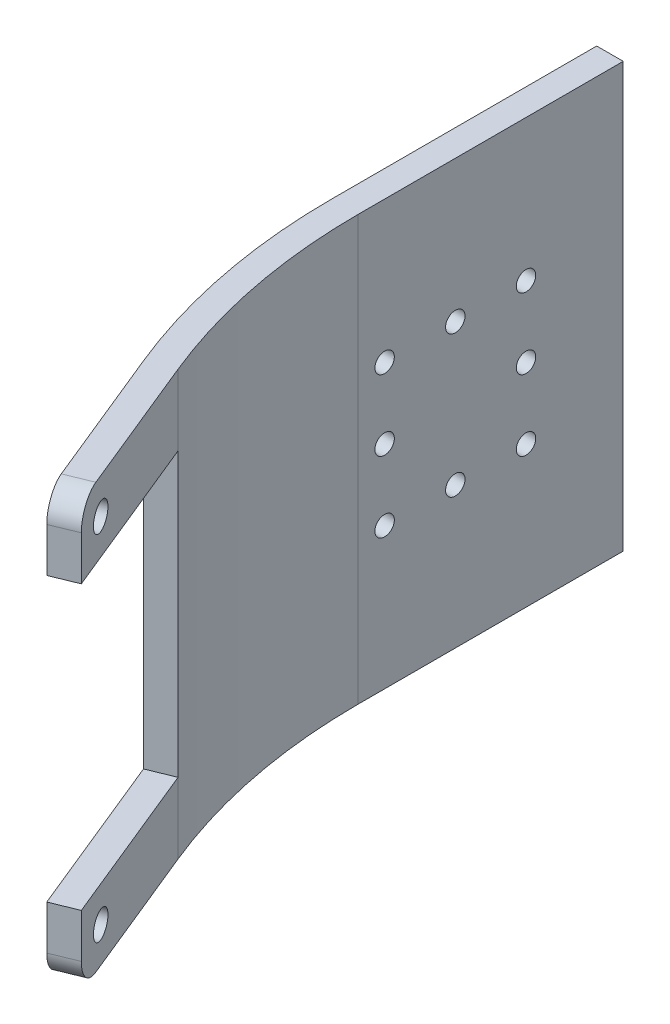
ISO-10303-21;
HEADER;
FILE_DESCRIPTION(('STEP AP214'),'2;1');
FILE_NAME('part.step','',(''),(''),'','','');
FILE_SCHEMA(('AUTOMOTIVE_DESIGN { 1 0 10303 214 1 1 1 1 }'));
ENDSEC;
DATA;
#1=APPLICATION_CONTEXT('core data for automotive mechanical design processes');
#2=APPLICATION_PROTOCOL_DEFINITION('international standard','automotive_design',2000,#1);
#3=PRODUCT_CONTEXT('',#1,'mechanical');
#4=PRODUCT('Part','Part','',(#3));
#5=PRODUCT_RELATED_PRODUCT_CATEGORY('part','',(#4));
#6=PRODUCT_DEFINITION_FORMATION('','',#4);
#7=PRODUCT_DEFINITION_CONTEXT('part definition',#1,'design');
#8=PRODUCT_DEFINITION('design','',#6,#7);
#9=PRODUCT_DEFINITION_SHAPE('','',#8);
#10=(LENGTH_UNIT() NAMED_UNIT(*) SI_UNIT(.MILLI.,.METRE.));
#11=(NAMED_UNIT(*) PLANE_ANGLE_UNIT() SI_UNIT($,.RADIAN.));
#12=(NAMED_UNIT(*) SI_UNIT($,.STERADIAN.) SOLID_ANGLE_UNIT());
#13=UNCERTAINTY_MEASURE_WITH_UNIT(LENGTH_MEASURE(1.E-05),#10,'distance_accuracy_value','');
#14=(GEOMETRIC_REPRESENTATION_CONTEXT(3) GLOBAL_UNCERTAINTY_ASSIGNED_CONTEXT((#13)) GLOBAL_UNIT_ASSIGNED_CONTEXT((#10,
#11,#12)) REPRESENTATION_CONTEXT('',''));
#15=CARTESIAN_POINT('',(0.,0.,0.));
#16=DIRECTION('',(0.,0.,1.));
#17=DIRECTION('',(1.,0.,0.));
#18=AXIS2_PLACEMENT_3D('',#15,#16,#17);
#19=CARTESIAN_POINT('',(5.20465717257355,48.,26.4870449064496));
#20=DIRECTION('',(0.925647754677521,0.,-0.378386355806422));
#21=DIRECTION('',(-0.378386355806423,0.,-0.925647754677521));
#22=AXIS2_PLACEMENT_3D('',#19,#20,#21);
#23=PLANE('',#22);
#24=CARTESIAN_POINT('',(11.2588388654763,44.,41.2974089812899));
#25=DIRECTION('',(-0.925647754677521,0.,0.378386355806422));
#26=DIRECTION('',(-0.378386355806422,0.,-0.925647754677521));
#27=AXIS2_PLACEMENT_3D('',#24,#25,#26);
#28=CIRCLE('',#27,1.5);
#29=CARTESIAN_POINT('',(10.6912593317667,44.,39.9089373492736));
#30=VERTEX_POINT('',#29);
#31=EDGE_CURVE('E364',#30,#30,#28,.T.);
#32=ORIENTED_EDGE('',*,*,#31,.F.);
#33=EDGE_LOOP('',(#32));
#34=FACE_BOUND('',#33,.T.);
#35=DIRECTION('',(0.,-1.,0.));
#36=VECTOR('',#35,1.);
#37=CARTESIAN_POINT('',(12.772384288702,48.,45.));
#38=LINE('',#37,#36);
#39=CARTESIAN_POINT('',(12.772384288702,45.,45.));
#40=VERTEX_POINT('',#39);
#41=CARTESIAN_POINT('',(12.772384288702,40.,45.));
#42=VERTEX_POINT('',#41);
#43=EDGE_CURVE('E175',#40,#42,#38,.T.);
#44=ORIENTED_EDGE('',*,*,#43,.F.);
#45=CARTESIAN_POINT('',(11.6372252212827,45.,42.2230567359674));
#46=DIRECTION('',(0.925647754677521,0.,-0.378386355806422));
#47=DIRECTION('',(-0.378386355806423,0.,-0.925647754677521));
#48=AXIS2_PLACEMENT_3D('',#45,#46,#47);
#49=CIRCLE('',#48,3.);
#50=CARTESIAN_POINT('',(11.6372252212827,48.,42.2230567359674));
#51=VERTEX_POINT('',#50);
#52=EDGE_CURVE('E11',#40,#51,#49,.F.);
#53=ORIENTED_EDGE('',*,*,#52,.T.);
#54=DIRECTION('',(0.378386355806422,0.,0.925647754677521));
#55=VECTOR('',#54,1.);
#56=CARTESIAN_POINT('',(5.20465717257355,48.,26.4870449064496));
#57=LINE('',#56,#55);
#58=CARTESIAN_POINT('',(5.20465717257355,48.,26.4870449064496));
#59=VERTEX_POINT('',#58);
#60=EDGE_CURVE('E199',#59,#51,#57,.T.);
#61=ORIENTED_EDGE('',*,*,#60,.F.);
#62=DIRECTION('',(0.,-1.,0.));
#63=VECTOR('',#62,1.);
#64=CARTESIAN_POINT('',(5.20465717257355,48.,26.4870449064496));
#65=LINE('',#64,#63);
#66=CARTESIAN_POINT('',(5.20465717257355,40.,26.4870449064496));
#67=VERTEX_POINT('',#66);
#68=EDGE_CURVE('E178',#59,#67,#65,.T.);
#69=ORIENTED_EDGE('',*,*,#68,.T.);
#70=DIRECTION('',(-0.378386355806423,0.,-0.925647754677521));
#71=VECTOR('',#70,1.);
#72=CARTESIAN_POINT('',(12.772384288702,40.,45.));
#73=LINE('',#72,#71);
#74=EDGE_CURVE('E137',#42,#67,#73,.T.);
#75=ORIENTED_EDGE('',*,*,#74,.F.);
#76=EDGE_LOOP('',(#44,#53,#61,#69,#75));
#77=FACE_BOUND('',#76,.T.);
#78=ADVANCED_FACE('F30',(#34,#77),#23,.F.);
#79=CARTESIAN_POINT('',(12.772384288702,48.,45.));
#80=DIRECTION('',(-0.378386355806423,0.,-0.92564775467752));
#81=DIRECTION('',(-0.92564775467752,0.,0.378386355806423));
#82=AXIS2_PLACEMENT_3D('',#79,#80,#81);
#83=PLANE('',#82);
#84=DIRECTION('',(0.,-1.,0.));
#85=VECTOR('',#84,1.);
#86=CARTESIAN_POINT('',(15.5493275527346,48.,43.8648409325807));
#87=LINE('',#86,#85);
#88=CARTESIAN_POINT('',(15.5493275527346,45.,43.8648409325807));
#89=VERTEX_POINT('',#88);
#90=CARTESIAN_POINT('',(15.5493275527346,40.,43.8648409325807));
#91=VERTEX_POINT('',#90);
#92=EDGE_CURVE('E159',#89,#91,#87,.T.);
#93=ORIENTED_EDGE('',*,*,#92,.F.);
#94=DIRECTION('',(0.92564775467752,0.,-0.378386355806423));
#95=VECTOR('',#94,1.);
#96=CARTESIAN_POINT('',(12.772384288702,45.,45.));
#97=LINE('',#96,#95);
#98=EDGE_CURVE('E38',#89,#40,#97,.F.);
#99=ORIENTED_EDGE('',*,*,#98,.T.);
#100=ORIENTED_EDGE('',*,*,#43,.T.);
#101=DIRECTION('',(-0.925647754677521,0.,0.378386355806422));
#102=VECTOR('',#101,1.);
#103=CARTESIAN_POINT('',(41.4218783986437,40.,33.2886577348907));
#104=LINE('',#103,#102);
#105=EDGE_CURVE('E153',#91,#42,#104,.T.);
#106=ORIENTED_EDGE('',*,*,#105,.F.);
#107=EDGE_LOOP('',(#93,#99,#100,#106));
#108=FACE_BOUND('',#107,.T.);
#109=ADVANCED_FACE('F277',(#108),#83,.F.);
#110=CARTESIAN_POINT('',(7.98160043660612,48.,25.3518858390303));
#111=DIRECTION('',(-0.925647754677521,0.,0.378386355806423));
#112=DIRECTION('',(0.378386355806423,0.,0.925647754677521));
#113=AXIS2_PLACEMENT_3D('',#110,#111,#112);
#114=PLANE('',#113);
#115=CARTESIAN_POINT('',(14.0357821295089,44.,40.1622499138706));
#116=DIRECTION('',(-0.925647754677521,0.,0.378386355806423));
#117=DIRECTION('',(0.378386355806423,0.,0.925647754677521));
#118=AXIS2_PLACEMENT_3D('',#115,#116,#117);
#119=CIRCLE('',#118,1.5);
#120=CARTESIAN_POINT('',(14.6033616632185,44.,41.5507215458869));
#121=VERTEX_POINT('',#120);
#122=EDGE_CURVE('E362',#121,#121,#119,.F.);
#123=ORIENTED_EDGE('',*,*,#122,.F.);
#124=EDGE_LOOP('',(#123));
#125=FACE_BOUND('',#124,.T.);
#126=DIRECTION('',(-0.378386355806423,0.,-0.925647754677521));
#127=VECTOR('',#126,1.);
#128=CARTESIAN_POINT('',(7.98160043660612,48.,25.3518858390303));
#129=LINE('',#128,#127);
#130=CARTESIAN_POINT('',(14.4141684853153,48.,41.0878976685482));
#131=VERTEX_POINT('',#130);
#132=CARTESIAN_POINT('',(7.98160043660612,48.,25.3518858390303));
#133=VERTEX_POINT('',#132);
#134=EDGE_CURVE('E197',#131,#133,#129,.T.);
#135=ORIENTED_EDGE('',*,*,#134,.F.);
#136=CARTESIAN_POINT('',(14.4141684853153,45.,41.0878976685482));
#137=DIRECTION('',(-0.925647754677521,0.,0.378386355806423));
#138=DIRECTION('',(0.378386355806423,0.,0.925647754677521));
#139=AXIS2_PLACEMENT_3D('',#136,#137,#138);
#140=CIRCLE('',#139,3.);
#141=EDGE_CURVE('E52',#131,#89,#140,.F.);
#142=ORIENTED_EDGE('',*,*,#141,.T.);
#143=ORIENTED_EDGE('',*,*,#92,.T.);
#144=DIRECTION('',(0.378386355806423,0.,0.925647754677521));
#145=VECTOR('',#144,1.);
#146=CARTESIAN_POINT('',(15.5493275527346,40.,43.8648409325807));
#147=LINE('',#146,#145);
#148=CARTESIAN_POINT('',(7.98160043660612,40.,25.3518858390303));
#149=VERTEX_POINT('',#148);
#150=EDGE_CURVE('E134',#149,#91,#147,.T.);
#151=ORIENTED_EDGE('',*,*,#150,.F.);
#152=DIRECTION('',(0.,-1.,0.));
#153=VECTOR('',#152,1.);
#154=CARTESIAN_POINT('',(7.98160043660612,48.,25.3518858390303));
#155=LINE('',#154,#153);
#156=EDGE_CURVE('E157',#133,#149,#155,.T.);
#157=ORIENTED_EDGE('',*,*,#156,.F.);
#158=EDGE_LOOP('',(#135,#142,#143,#151,#157));
#159=FACE_BOUND('',#158,.T.);
#160=ADVANCED_FACE('F156',(#125,#159),#114,.F.);
#161=CARTESIAN_POINT('',(70.,48.,0.));
#162=DIRECTION('',(0.,-1.,0.));
#163=DIRECTION('',(0.,0.,-1.));
#164=AXIS2_PLACEMENT_3D('',#161,#162,#163);
#165=CYLINDRICAL_SURFACE('',#164,70.);
#166=CARTESIAN_POINT('',(70.,0.,0.));
#167=DIRECTION('',(0.,1.,0.));
#168=DIRECTION('',(0.,0.,1.));
#169=AXIS2_PLACEMENT_3D('',#166,#167,#168);
#170=CIRCLE('',#169,70.);
#171=CARTESIAN_POINT('',(0.,0.,0.));
#172=VERTEX_POINT('',#171);
#173=CARTESIAN_POINT('',(5.20465717257355,0.,26.4870449064496));
#174=VERTEX_POINT('',#173);
#175=EDGE_CURVE('E152',#172,#174,#170,.T.);
#176=ORIENTED_EDGE('',*,*,#175,.T.);
#177=CARTESIAN_POINT('',(5.20465717257355,8.,26.4870449064496));
#178=VERTEX_POINT('',#177);
#179=EDGE_CURVE('E177',#178,#174,#65,.T.);
#180=ORIENTED_EDGE('',*,*,#179,.F.);
#181=DIRECTION('',(0.,-1.,0.));
#182=VECTOR('',#181,1.);
#183=CARTESIAN_POINT('',(5.20465717257355,8.,26.4870449064496));
#184=LINE('',#183,#182);
#185=EDGE_CURVE('E262',#67,#178,#184,.T.);
#186=ORIENTED_EDGE('',*,*,#185,.F.);
#187=ORIENTED_EDGE('',*,*,#68,.F.);
#188=CARTESIAN_POINT('',(70.,48.,0.));
#189=DIRECTION('',(0.,1.,0.));
#190=DIRECTION('',(0.,0.,1.));
#191=AXIS2_PLACEMENT_3D('',#188,#189,#190);
#192=CIRCLE('',#191,70.);
#193=CARTESIAN_POINT('',(0.,48.,0.));
#194=VERTEX_POINT('',#193);
#195=EDGE_CURVE('E205',#194,#59,#192,.T.);
#196=ORIENTED_EDGE('',*,*,#195,.F.);
#197=DIRECTION('',(0.,-1.,0.));
#198=VECTOR('',#197,1.);
#199=CARTESIAN_POINT('',(0.,48.,0.));
#200=LINE('',#199,#198);
#201=EDGE_CURVE('E214',#194,#172,#200,.T.);
#202=ORIENTED_EDGE('',*,*,#201,.T.);
#203=EDGE_LOOP('',(#176,#180,#186,#187,#196,#202));
#204=FACE_BOUND('',#203,.T.);
#205=ADVANCED_FACE('F260',(#204),#165,.T.);
#206=CARTESIAN_POINT('',(11.2588388654763,4.,41.2974089812899));
#207=DIRECTION('',(-0.925647754677521,0.,0.378386355806422));
#208=DIRECTION('',(0.378386355806422,0.,0.925647754677521));
#209=AXIS2_PLACEMENT_3D('',#206,#207,#208);
#210=CIRCLE('',#209,1.5);
#211=CARTESIAN_POINT('',(11.8264183991859,4.,42.6858806133062));
#212=VERTEX_POINT('',#211);
#213=EDGE_CURVE('E299',#212,#212,#210,.T.);
#214=ORIENTED_EDGE('',*,*,#213,.F.);
#215=EDGE_LOOP('',(#214));
#216=FACE_BOUND('',#215,.T.);
#217=DIRECTION('',(0.378386355806422,0.,0.925647754677521));
#218=VECTOR('',#217,1.);
#219=CARTESIAN_POINT('',(5.20465717257355,0.,26.4870449064496));
#220=LINE('',#219,#218);
#221=CARTESIAN_POINT('',(11.6372252212827,0.,42.2230567359674));
#222=VERTEX_POINT('',#221);
#223=EDGE_CURVE('E217',#174,#222,#220,.T.);
#224=ORIENTED_EDGE('',*,*,#223,.T.);
#225=CARTESIAN_POINT('',(11.6372252212827,3.,42.2230567359674));
#226=DIRECTION('',(0.925647754677521,0.,-0.378386355806422));
#227=DIRECTION('',(-0.378386355806423,0.,-0.925647754677521));
#228=AXIS2_PLACEMENT_3D('',#225,#226,#227);
#229=CIRCLE('',#228,3.);
#230=CARTESIAN_POINT('',(12.772384288702,3.,45.));
#231=VERTEX_POINT('',#230);
#232=EDGE_CURVE('E188',#222,#231,#229,.F.);
#233=ORIENTED_EDGE('',*,*,#232,.T.);
#234=CARTESIAN_POINT('',(12.772384288702,8.,45.));
#235=VERTEX_POINT('',#234);
#236=EDGE_CURVE('E174',#235,#231,#38,.T.);
#237=ORIENTED_EDGE('',*,*,#236,.F.);
#238=DIRECTION('',(0.378386355806422,0.,0.925647754677521));
#239=VECTOR('',#238,1.);
#240=CARTESIAN_POINT('',(12.772384288702,8.,45.));
#241=LINE('',#240,#239);
#242=EDGE_CURVE('E142',#178,#235,#241,.T.);
#243=ORIENTED_EDGE('',*,*,#242,.F.);
#244=ORIENTED_EDGE('',*,*,#179,.T.);
#245=EDGE_LOOP('',(#224,#233,#237,#243,#244));
#246=FACE_BOUND('',#245,.T.);
#247=ADVANCED_FACE('F280',(#216,#246),#23,.F.);
#248=ORIENTED_EDGE('',*,*,#236,.T.);
#249=DIRECTION('',(0.92564775467752,0.,-0.378386355806423));
#250=VECTOR('',#249,1.);
#251=CARTESIAN_POINT('',(12.772384288702,3.,45.));
#252=LINE('',#251,#250);
#253=CARTESIAN_POINT('',(15.5493275527346,3.,43.8648409325807));
#254=VERTEX_POINT('',#253);
#255=EDGE_CURVE('E181',#231,#254,#252,.T.);
#256=ORIENTED_EDGE('',*,*,#255,.T.);
#257=CARTESIAN_POINT('',(15.5493275527346,8.,43.8648409325807));
#258=VERTEX_POINT('',#257);
#259=EDGE_CURVE('E165',#258,#254,#87,.T.);
#260=ORIENTED_EDGE('',*,*,#259,.F.);
#261=DIRECTION('',(-0.925647754677521,0.,0.378386355806422));
#262=VECTOR('',#261,1.);
#263=CARTESIAN_POINT('',(41.4218783986437,8.,33.2886577348907));
#264=LINE('',#263,#262);
#265=EDGE_CURVE('E322',#258,#235,#264,.T.);
#266=ORIENTED_EDGE('',*,*,#265,.T.);
#267=EDGE_LOOP('',(#248,#256,#260,#266));
#268=FACE_BOUND('',#267,.T.);
#269=ADVANCED_FACE('F285',(#268),#83,.F.);
#270=CARTESIAN_POINT('',(14.0357821295089,4.,40.1622499138706));
#271=DIRECTION('',(-0.925647754677521,0.,0.378386355806423));
#272=DIRECTION('',(0.378386355806423,0.,0.925647754677521));
#273=AXIS2_PLACEMENT_3D('',#270,#271,#272);
#274=CIRCLE('',#273,1.5);
#275=CARTESIAN_POINT('',(14.6033616632185,4.,41.5507215458869));
#276=VERTEX_POINT('',#275);
#277=EDGE_CURVE('E312',#276,#276,#274,.F.);
#278=ORIENTED_EDGE('',*,*,#277,.F.);
#279=EDGE_LOOP('',(#278));
#280=FACE_BOUND('',#279,.T.);
#281=ORIENTED_EDGE('',*,*,#259,.T.);
#282=CARTESIAN_POINT('',(14.4141684853153,3.,41.0878976685482));
#283=DIRECTION('',(-0.925647754677521,0.,0.378386355806423));
#284=DIRECTION('',(0.378386355806423,0.,0.925647754677521));
#285=AXIS2_PLACEMENT_3D('',#282,#283,#284);
#286=CIRCLE('',#285,3.);
#287=CARTESIAN_POINT('',(14.4141684853153,0.,41.0878976685482));
#288=VERTEX_POINT('',#287);
#289=EDGE_CURVE('E184',#254,#288,#286,.F.);
#290=ORIENTED_EDGE('',*,*,#289,.T.);
#291=DIRECTION('',(-0.378386355806423,0.,-0.925647754677521));
#292=VECTOR('',#291,1.);
#293=CARTESIAN_POINT('',(7.98160043660612,0.,25.3518858390303));
#294=LINE('',#293,#292);
#295=CARTESIAN_POINT('',(7.98160043660612,0.,25.3518858390303));
#296=VERTEX_POINT('',#295);
#297=EDGE_CURVE('E220',#288,#296,#294,.T.);
#298=ORIENTED_EDGE('',*,*,#297,.T.);
#299=CARTESIAN_POINT('',(7.98160043660612,8.,25.3518858390303));
#300=VERTEX_POINT('',#299);
#301=EDGE_CURVE('E166',#300,#296,#155,.T.);
#302=ORIENTED_EDGE('',*,*,#301,.F.);
#303=DIRECTION('',(-0.378386355806423,0.,-0.925647754677521));
#304=VECTOR('',#303,1.);
#305=CARTESIAN_POINT('',(15.5493275527346,8.,43.8648409325807));
#306=LINE('',#305,#304);
#307=EDGE_CURVE('E160',#258,#300,#306,.T.);
#308=ORIENTED_EDGE('',*,*,#307,.F.);
#309=EDGE_LOOP('',(#281,#290,#298,#302,#308));
#310=FACE_BOUND('',#309,.T.);
#311=ADVANCED_FACE('F294',(#280,#310),#114,.F.);
#312=CARTESIAN_POINT('',(70.,48.,0.));
#313=DIRECTION('',(0.,-1.,0.));
#314=DIRECTION('',(0.,0.,-1.));
#315=AXIS2_PLACEMENT_3D('',#312,#313,#314);
#316=CYLINDRICAL_SURFACE('',#315,67.);
#317=CARTESIAN_POINT('',(70.,0.,0.));
#318=DIRECTION('',(0.,-1.,0.));
#319=DIRECTION('',(0.,0.,1.));
#320=AXIS2_PLACEMENT_3D('',#317,#318,#319);
#321=CIRCLE('',#320,67.);
#322=CARTESIAN_POINT('',(3.00000000000001,0.,7.12266617214352E-13));
#323=VERTEX_POINT('',#322);
#324=EDGE_CURVE('E222',#296,#323,#321,.T.);
#325=ORIENTED_EDGE('',*,*,#324,.T.);
#326=DIRECTION('',(0.,-1.,0.));
#327=VECTOR('',#326,1.);
#328=CARTESIAN_POINT('',(3.00000000000001,48.,7.12266617214352E-13));
#329=LINE('',#328,#327);
#330=CARTESIAN_POINT('',(3.00000000000001,48.,7.12266617214352E-13));
#331=VERTEX_POINT('',#330);
#332=EDGE_CURVE('E170',#331,#323,#329,.T.);
#333=ORIENTED_EDGE('',*,*,#332,.F.);
#334=CARTESIAN_POINT('',(70.,48.,0.));
#335=DIRECTION('',(0.,-1.,0.));
#336=DIRECTION('',(0.,0.,1.));
#337=AXIS2_PLACEMENT_3D('',#334,#335,#336);
#338=CIRCLE('',#337,67.);
#339=EDGE_CURVE('E164',#133,#331,#338,.T.);
#340=ORIENTED_EDGE('',*,*,#339,.F.);
#341=ORIENTED_EDGE('',*,*,#156,.T.);
#342=DIRECTION('',(0.,-1.,0.));
#343=VECTOR('',#342,1.);
#344=CARTESIAN_POINT('',(7.98160043660611,48.,25.3518858390303));
#345=LINE('',#344,#343);
#346=EDGE_CURVE('E146',#300,#149,#345,.F.);
#347=ORIENTED_EDGE('',*,*,#346,.F.);
#348=ORIENTED_EDGE('',*,*,#301,.T.);
#349=EDGE_LOOP('',(#325,#333,#340,#341,#347,#348));
#350=FACE_BOUND('',#349,.T.);
#351=ADVANCED_FACE('F162',(#350),#316,.F.);
#352=CARTESIAN_POINT('',(3.,48.,-30.));
#353=DIRECTION('',(-1.,0.,0.));
#354=DIRECTION('',(0.,0.,1.));
#355=AXIS2_PLACEMENT_3D('',#352,#353,#354);
#356=PLANE('',#355);
#357=CARTESIAN_POINT('',(3.00000000000001,32.,-2.99999999999999));
#358=DIRECTION('',(1.,0.,0.));
#359=DIRECTION('',(0.,0.,1.));
#360=AXIS2_PLACEMENT_3D('',#357,#358,#359);
#361=CIRCLE('',#360,1.1);
#362=CARTESIAN_POINT('',(3.00000000000001,32.,-1.89999999999999));
#363=VERTEX_POINT('',#362);
#364=EDGE_CURVE('E414',#363,#363,#361,.T.);
#365=ORIENTED_EDGE('',*,*,#364,.F.);
#366=EDGE_LOOP('',(#365));
#367=FACE_BOUND('',#366,.T.);
#368=CARTESIAN_POINT('',(3.,32.,-11.));
#369=DIRECTION('',(1.,0.,0.));
#370=DIRECTION('',(0.,0.,1.));
#371=AXIS2_PLACEMENT_3D('',#368,#369,#370);
#372=CIRCLE('',#371,1.1);
#373=CARTESIAN_POINT('',(3.,32.,-9.9));
#374=VERTEX_POINT('',#373);
#375=EDGE_CURVE('E408',#374,#374,#372,.T.);
#376=ORIENTED_EDGE('',*,*,#375,.F.);
#377=EDGE_LOOP('',(#376));
#378=FACE_BOUND('',#377,.T.);
#379=CARTESIAN_POINT('',(3.,32.,-19.));
#380=DIRECTION('',(1.,0.,0.));
#381=DIRECTION('',(0.,0.,1.));
#382=AXIS2_PLACEMENT_3D('',#379,#380,#381);
#383=CIRCLE('',#382,1.1);
#384=CARTESIAN_POINT('',(3.,32.,-17.9));
#385=VERTEX_POINT('',#384);
#386=EDGE_CURVE('E402',#385,#385,#383,.T.);
#387=ORIENTED_EDGE('',*,*,#386,.F.);
#388=EDGE_LOOP('',(#387));
#389=FACE_BOUND('',#388,.T.);
#390=CARTESIAN_POINT('',(3.,24.,-19.));
#391=DIRECTION('',(1.,0.,0.));
#392=DIRECTION('',(0.,0.,-1.));
#393=AXIS2_PLACEMENT_3D('',#390,#391,#392);
#394=CIRCLE('',#393,1.1);
#395=CARTESIAN_POINT('',(3.,24.,-20.1));
#396=VERTEX_POINT('',#395);
#397=EDGE_CURVE('E396',#396,#396,#394,.T.);
#398=ORIENTED_EDGE('',*,*,#397,.F.);
#399=EDGE_LOOP('',(#398));
#400=FACE_BOUND('',#399,.T.);
#401=CARTESIAN_POINT('',(3.00000000000001,24.,-3.));
#402=DIRECTION('',(1.,0.,0.));
#403=DIRECTION('',(0.,0.,-1.));
#404=AXIS2_PLACEMENT_3D('',#401,#402,#403);
#405=CIRCLE('',#404,1.1);
#406=CARTESIAN_POINT('',(3.,24.,-4.1));
#407=VERTEX_POINT('',#406);
#408=EDGE_CURVE('E390',#407,#407,#405,.T.);
#409=ORIENTED_EDGE('',*,*,#408,.F.);
#410=EDGE_LOOP('',(#409));
#411=FACE_BOUND('',#410,.T.);
#412=CARTESIAN_POINT('',(3.,16.,-19.));
#413=DIRECTION('',(1.,0.,0.));
#414=DIRECTION('',(0.,0.,-1.));
#415=AXIS2_PLACEMENT_3D('',#412,#413,#414);
#416=CIRCLE('',#415,1.1);
#417=CARTESIAN_POINT('',(3.,16.,-20.1));
#418=VERTEX_POINT('',#417);
#419=EDGE_CURVE('E384',#418,#418,#416,.T.);
#420=ORIENTED_EDGE('',*,*,#419,.F.);
#421=EDGE_LOOP('',(#420));
#422=FACE_BOUND('',#421,.T.);
#423=CARTESIAN_POINT('',(3.,16.,-11.));
#424=DIRECTION('',(1.,0.,0.));
#425=DIRECTION('',(0.,0.,-1.));
#426=AXIS2_PLACEMENT_3D('',#423,#424,#425);
#427=CIRCLE('',#426,1.1);
#428=CARTESIAN_POINT('',(3.,16.,-12.1));
#429=VERTEX_POINT('',#428);
#430=EDGE_CURVE('E378',#429,#429,#427,.T.);
#431=ORIENTED_EDGE('',*,*,#430,.F.);
#432=EDGE_LOOP('',(#431));
#433=FACE_BOUND('',#432,.T.);
#434=CARTESIAN_POINT('',(3.00000000000001,16.,-3.));
#435=DIRECTION('',(1.,0.,0.));
#436=DIRECTION('',(0.,0.,-1.));
#437=AXIS2_PLACEMENT_3D('',#434,#435,#436);
#438=CIRCLE('',#437,1.1);
#439=CARTESIAN_POINT('',(3.,16.,-4.1));
#440=VERTEX_POINT('',#439);
#441=EDGE_CURVE('E372',#440,#440,#438,.T.);
#442=ORIENTED_EDGE('',*,*,#441,.F.);
#443=EDGE_LOOP('',(#442));
#444=FACE_BOUND('',#443,.T.);
#445=DIRECTION('',(0.,0.,-1.));
#446=VECTOR('',#445,1.);
#447=CARTESIAN_POINT('',(3.,0.,-30.));
#448=LINE('',#447,#446);
#449=CARTESIAN_POINT('',(3.,0.,-30.));
#450=VERTEX_POINT('',#449);
#451=EDGE_CURVE('E224',#323,#450,#448,.T.);
#452=ORIENTED_EDGE('',*,*,#451,.T.);
#453=DIRECTION('',(0.,-1.,0.));
#454=VECTOR('',#453,1.);
#455=CARTESIAN_POINT('',(3.,48.,-30.));
#456=LINE('',#455,#454);
#457=CARTESIAN_POINT('',(3.,48.,-30.));
#458=VERTEX_POINT('',#457);
#459=EDGE_CURVE('E234',#458,#450,#456,.T.);
#460=ORIENTED_EDGE('',*,*,#459,.F.);
#461=DIRECTION('',(0.,0.,-1.));
#462=VECTOR('',#461,1.);
#463=CARTESIAN_POINT('',(3.,48.,-30.));
#464=LINE('',#463,#462);
#465=EDGE_CURVE('E203',#331,#458,#464,.T.);
#466=ORIENTED_EDGE('',*,*,#465,.F.);
#467=ORIENTED_EDGE('',*,*,#332,.T.);
#468=EDGE_LOOP('',(#452,#460,#466,#467));
#469=FACE_BOUND('',#468,.T.);
#470=ADVANCED_FACE('F244',(#367,#378,#389,#400,#411,#422,#433,#444,#469),#356,.F.);
#471=CARTESIAN_POINT('',(0.,48.,-30.));
#472=DIRECTION('',(0.,0.,1.));
#473=DIRECTION('',(1.,0.,0.));
#474=AXIS2_PLACEMENT_3D('',#471,#472,#473);
#475=PLANE('',#474);
#476=DIRECTION('',(-1.,0.,0.));
#477=VECTOR('',#476,1.);
#478=CARTESIAN_POINT('',(0.,0.,-30.));
#479=LINE('',#478,#477);
#480=CARTESIAN_POINT('',(0.,0.,-30.));
#481=VERTEX_POINT('',#480);
#482=EDGE_CURVE('E226',#450,#481,#479,.T.);
#483=ORIENTED_EDGE('',*,*,#482,.T.);
#484=DIRECTION('',(0.,-1.,0.));
#485=VECTOR('',#484,1.);
#486=CARTESIAN_POINT('',(0.,48.,-30.));
#487=LINE('',#486,#485);
#488=CARTESIAN_POINT('',(0.,48.,-30.));
#489=VERTEX_POINT('',#488);
#490=EDGE_CURVE('E232',#489,#481,#487,.T.);
#491=ORIENTED_EDGE('',*,*,#490,.F.);
#492=DIRECTION('',(-1.,0.,0.));
#493=VECTOR('',#492,1.);
#494=CARTESIAN_POINT('',(0.,48.,-30.));
#495=LINE('',#494,#493);
#496=EDGE_CURVE('E210',#458,#489,#495,.T.);
#497=ORIENTED_EDGE('',*,*,#496,.F.);
#498=ORIENTED_EDGE('',*,*,#459,.T.);
#499=EDGE_LOOP('',(#483,#491,#497,#498));
#500=FACE_BOUND('',#499,.T.);
#501=ADVANCED_FACE('F252',(#500),#475,.F.);
#502=CARTESIAN_POINT('',(0.,48.,0.));
#503=DIRECTION('',(1.,0.,0.));
#504=DIRECTION('',(0.,0.,-1.));
#505=AXIS2_PLACEMENT_3D('',#502,#503,#504);
#506=PLANE('',#505);
#507=CARTESIAN_POINT('',(0.,32.,-2.99999999999999));
#508=DIRECTION('',(1.,0.,0.));
#509=DIRECTION('',(0.,0.,-1.));
#510=AXIS2_PLACEMENT_3D('',#507,#508,#509);
#511=CIRCLE('',#510,1.1);
#512=CARTESIAN_POINT('',(0.,32.,-4.1));
#513=VERTEX_POINT('',#512);
#514=EDGE_CURVE('E411',#513,#513,#511,.F.);
#515=ORIENTED_EDGE('',*,*,#514,.F.);
#516=EDGE_LOOP('',(#515));
#517=FACE_BOUND('',#516,.T.);
#518=CARTESIAN_POINT('',(0.,32.,-11.));
#519=DIRECTION('',(1.,0.,0.));
#520=DIRECTION('',(0.,0.,-1.));
#521=AXIS2_PLACEMENT_3D('',#518,#519,#520);
#522=CIRCLE('',#521,1.1);
#523=CARTESIAN_POINT('',(0.,32.,-12.1));
#524=VERTEX_POINT('',#523);
#525=EDGE_CURVE('E405',#524,#524,#522,.F.);
#526=ORIENTED_EDGE('',*,*,#525,.F.);
#527=EDGE_LOOP('',(#526));
#528=FACE_BOUND('',#527,.T.);
#529=CARTESIAN_POINT('',(0.,32.,-19.));
#530=DIRECTION('',(1.,0.,0.));
#531=DIRECTION('',(0.,0.,-1.));
#532=AXIS2_PLACEMENT_3D('',#529,#530,#531);
#533=CIRCLE('',#532,1.1);
#534=CARTESIAN_POINT('',(0.,32.,-20.1));
#535=VERTEX_POINT('',#534);
#536=EDGE_CURVE('E399',#535,#535,#533,.F.);
#537=ORIENTED_EDGE('',*,*,#536,.F.);
#538=EDGE_LOOP('',(#537));
#539=FACE_BOUND('',#538,.T.);
#540=CARTESIAN_POINT('',(0.,24.,-19.));
#541=DIRECTION('',(1.,0.,0.));
#542=DIRECTION('',(0.,0.,-1.));
#543=AXIS2_PLACEMENT_3D('',#540,#541,#542);
#544=CIRCLE('',#543,1.1);
#545=CARTESIAN_POINT('',(0.,24.,-20.1));
#546=VERTEX_POINT('',#545);
#547=EDGE_CURVE('E393',#546,#546,#544,.F.);
#548=ORIENTED_EDGE('',*,*,#547,.F.);
#549=EDGE_LOOP('',(#548));
#550=FACE_BOUND('',#549,.T.);
#551=CARTESIAN_POINT('',(0.,24.,-3.));
#552=DIRECTION('',(1.,0.,0.));
#553=DIRECTION('',(0.,0.,-1.));
#554=AXIS2_PLACEMENT_3D('',#551,#552,#553);
#555=CIRCLE('',#554,1.1);
#556=CARTESIAN_POINT('',(0.,24.,-4.1));
#557=VERTEX_POINT('',#556);
#558=EDGE_CURVE('E387',#557,#557,#555,.F.);
#559=ORIENTED_EDGE('',*,*,#558,.F.);
#560=EDGE_LOOP('',(#559));
#561=FACE_BOUND('',#560,.T.);
#562=CARTESIAN_POINT('',(0.,16.,-19.));
#563=DIRECTION('',(1.,0.,0.));
#564=DIRECTION('',(0.,0.,-1.));
#565=AXIS2_PLACEMENT_3D('',#562,#563,#564);
#566=CIRCLE('',#565,1.1);
#567=CARTESIAN_POINT('',(0.,16.,-20.1));
#568=VERTEX_POINT('',#567);
#569=EDGE_CURVE('E381',#568,#568,#566,.F.);
#570=ORIENTED_EDGE('',*,*,#569,.F.);
#571=EDGE_LOOP('',(#570));
#572=FACE_BOUND('',#571,.T.);
#573=CARTESIAN_POINT('',(0.,16.,-11.));
#574=DIRECTION('',(1.,0.,0.));
#575=DIRECTION('',(0.,0.,-1.));
#576=AXIS2_PLACEMENT_3D('',#573,#574,#575);
#577=CIRCLE('',#576,1.1);
#578=CARTESIAN_POINT('',(0.,16.,-12.1));
#579=VERTEX_POINT('',#578);
#580=EDGE_CURVE('E375',#579,#579,#577,.F.);
#581=ORIENTED_EDGE('',*,*,#580,.F.);
#582=EDGE_LOOP('',(#581));
#583=FACE_BOUND('',#582,.T.);
#584=CARTESIAN_POINT('',(0.,16.,-3.));
#585=DIRECTION('',(1.,0.,0.));
#586=DIRECTION('',(0.,0.,-1.));
#587=AXIS2_PLACEMENT_3D('',#584,#585,#586);
#588=CIRCLE('',#587,1.1);
#589=CARTESIAN_POINT('',(0.,16.,-4.1));
#590=VERTEX_POINT('',#589);
#591=EDGE_CURVE('E367',#590,#590,#588,.F.);
#592=ORIENTED_EDGE('',*,*,#591,.F.);
#593=EDGE_LOOP('',(#592));
#594=FACE_BOUND('',#593,.T.);
#595=DIRECTION('',(0.,0.,1.));
#596=VECTOR('',#595,1.);
#597=CARTESIAN_POINT('',(0.,0.,0.));
#598=LINE('',#597,#596);
#599=EDGE_CURVE('E228',#481,#172,#598,.T.);
#600=ORIENTED_EDGE('',*,*,#599,.T.);
#601=ORIENTED_EDGE('',*,*,#201,.F.);
#602=DIRECTION('',(0.,0.,1.));
#603=VECTOR('',#602,1.);
#604=CARTESIAN_POINT('',(0.,48.,0.));
#605=LINE('',#604,#603);
#606=EDGE_CURVE('E212',#489,#194,#605,.T.);
#607=ORIENTED_EDGE('',*,*,#606,.F.);
#608=ORIENTED_EDGE('',*,*,#490,.T.);
#609=EDGE_LOOP('',(#600,#601,#607,#608));
#610=FACE_BOUND('',#609,.T.);
#611=ADVANCED_FACE('F255',(#517,#528,#539,#550,#561,#572,#583,#594,#610),#506,.F.);
#612=CARTESIAN_POINT('',(70.,48.,0.));
#613=DIRECTION('',(0.,1.,0.));
#614=DIRECTION('',(0.,0.,1.));
#615=AXIS2_PLACEMENT_3D('',#612,#613,#614);
#616=PLANE('',#615);
#617=ORIENTED_EDGE('',*,*,#60,.T.);
#618=DIRECTION('',(0.92564775467752,0.,-0.378386355806423));
#619=VECTOR('',#618,1.);
#620=CARTESIAN_POINT('',(14.4141684853153,48.,41.0878976685482));
#621=LINE('',#620,#619);
#622=EDGE_CURVE('E190',#51,#131,#621,.T.);
#623=ORIENTED_EDGE('',*,*,#622,.T.);
#624=ORIENTED_EDGE('',*,*,#134,.T.);
#625=ORIENTED_EDGE('',*,*,#339,.T.);
#626=ORIENTED_EDGE('',*,*,#465,.T.);
#627=ORIENTED_EDGE('',*,*,#496,.T.);
#628=ORIENTED_EDGE('',*,*,#606,.T.);
#629=ORIENTED_EDGE('',*,*,#195,.T.);
#630=EDGE_LOOP('',(#617,#623,#624,#625,#626,#627,#628,#629));
#631=FACE_BOUND('',#630,.T.);
#632=ADVANCED_FACE('F196',(#631),#616,.T.);
#633=CARTESIAN_POINT('',(70.,0.,0.));
#634=DIRECTION('',(0.,1.,0.));
#635=DIRECTION('',(0.,0.,1.));
#636=AXIS2_PLACEMENT_3D('',#633,#634,#635);
#637=PLANE('',#636);
#638=ORIENTED_EDGE('',*,*,#297,.F.);
#639=DIRECTION('',(0.92564775467752,0.,-0.378386355806423));
#640=VECTOR('',#639,1.);
#641=CARTESIAN_POINT('',(76.4325680487092,0.,15.7360118295178));
#642=LINE('',#641,#640);
#643=EDGE_CURVE('E186',#288,#222,#642,.F.);
#644=ORIENTED_EDGE('',*,*,#643,.T.);
#645=ORIENTED_EDGE('',*,*,#223,.F.);
#646=ORIENTED_EDGE('',*,*,#175,.F.);
#647=ORIENTED_EDGE('',*,*,#599,.F.);
#648=ORIENTED_EDGE('',*,*,#482,.F.);
#649=ORIENTED_EDGE('',*,*,#451,.F.);
#650=ORIENTED_EDGE('',*,*,#324,.F.);
#651=EDGE_LOOP('',(#638,#644,#645,#646,#647,#648,#649,#650));
#652=FACE_BOUND('',#651,.T.);
#653=ADVANCED_FACE('F248',(#652),#637,.F.);
#654=CARTESIAN_POINT('',(41.4218783986437,40.,33.2886577348907));
#655=DIRECTION('',(0.,1.,0.));
#656=DIRECTION('',(0.,0.,1.));
#657=AXIS2_PLACEMENT_3D('',#654,#655,#656);
#658=PLANE('',#657);
#659=ORIENTED_EDGE('',*,*,#150,.T.);
#660=ORIENTED_EDGE('',*,*,#105,.T.);
#661=ORIENTED_EDGE('',*,*,#74,.T.);
#662=DIRECTION('',(-0.925647754677521,0.,0.378386355806422));
#663=VECTOR('',#662,1.);
#664=CARTESIAN_POINT('',(33.8541512825152,40.,14.7757026413403));
#665=LINE('',#664,#663);
#666=EDGE_CURVE('E129',#149,#67,#665,.T.);
#667=ORIENTED_EDGE('',*,*,#666,.F.);
#668=EDGE_LOOP('',(#659,#660,#661,#667));
#669=FACE_BOUND('',#668,.T.);
#670=ADVANCED_FACE('F131',(#669),#658,.F.);
#671=CARTESIAN_POINT('',(41.4218783986437,8.,33.2886577348907));
#672=DIRECTION('',(0.,-1.,0.));
#673=DIRECTION('',(0.,0.,-1.));
#674=AXIS2_PLACEMENT_3D('',#671,#672,#673);
#675=PLANE('',#674);
#676=ORIENTED_EDGE('',*,*,#307,.T.);
#677=DIRECTION('',(-0.925647754677521,0.,0.378386355806422));
#678=VECTOR('',#677,1.);
#679=CARTESIAN_POINT('',(33.8541512825152,8.,14.7757026413403));
#680=LINE('',#679,#678);
#681=EDGE_CURVE('E141',#300,#178,#680,.T.);
#682=ORIENTED_EDGE('',*,*,#681,.T.);
#683=ORIENTED_EDGE('',*,*,#242,.T.);
#684=ORIENTED_EDGE('',*,*,#265,.F.);
#685=EDGE_LOOP('',(#676,#682,#683,#684));
#686=FACE_BOUND('',#685,.T.);
#687=ADVANCED_FACE('F324',(#686),#675,.F.);
#688=CARTESIAN_POINT('',(33.8541512825152,8.,14.7757026413403));
#689=DIRECTION('',(-0.378386355806422,0.,-0.925647754677521));
#690=DIRECTION('',(-0.925647754677521,0.,0.378386355806422));
#691=AXIS2_PLACEMENT_3D('',#688,#689,#690);
#692=PLANE('',#691);
#693=ORIENTED_EDGE('',*,*,#346,.T.);
#694=ORIENTED_EDGE('',*,*,#666,.T.);
#695=ORIENTED_EDGE('',*,*,#185,.T.);
#696=ORIENTED_EDGE('',*,*,#681,.F.);
#697=EDGE_LOOP('',(#693,#694,#695,#696));
#698=FACE_BOUND('',#697,.T.);
#699=ADVANCED_FACE('F147',(#698),#692,.F.);
#700=CARTESIAN_POINT('',(39.908332975418,4.,29.5860667161806));
#701=DIRECTION('',(-0.925647754677521,0.,0.378386355806422));
#702=DIRECTION('',(0.378386355806422,0.,0.925647754677521));
#703=AXIS2_PLACEMENT_3D('',#700,#701,#702);
#704=CYLINDRICAL_SURFACE('',#703,1.5);
#705=ORIENTED_EDGE('',*,*,#213,.T.);
#706=EDGE_LOOP('',(#705));
#707=FACE_BOUND('',#706,.T.);
#708=ORIENTED_EDGE('',*,*,#277,.T.);
#709=EDGE_LOOP('',(#708));
#710=FACE_BOUND('',#709,.T.);
#711=ADVANCED_FACE('F331',(#707,#710),#704,.F.);
#712=CARTESIAN_POINT('',(39.908332975418,44.,29.5860667161806));
#713=DIRECTION('',(-0.925647754677521,0.,0.378386355806422));
#714=DIRECTION('',(0.378386355806422,0.,0.925647754677521));
#715=AXIS2_PLACEMENT_3D('',#712,#713,#714);
#716=CYLINDRICAL_SURFACE('',#715,1.5);
#717=ORIENTED_EDGE('',*,*,#31,.T.);
#718=EDGE_LOOP('',(#717));
#719=FACE_BOUND('',#718,.T.);
#720=ORIENTED_EDGE('',*,*,#122,.T.);
#721=EDGE_LOOP('',(#720));
#722=FACE_BOUND('',#721,.T.);
#723=ADVANCED_FACE('F274',(#719,#722),#716,.F.);
#724=CARTESIAN_POINT('',(11.6372252212827,3.,42.2230567359674));
#725=DIRECTION('',(0.92564775467752,0.,-0.378386355806423));
#726=DIRECTION('',(-0.378386355806423,0.,-0.92564775467752));
#727=AXIS2_PLACEMENT_3D('',#724,#725,#726);
#728=CYLINDRICAL_SURFACE('',#727,3.);
#729=ORIENTED_EDGE('',*,*,#232,.F.);
#730=ORIENTED_EDGE('',*,*,#643,.F.);
#731=ORIENTED_EDGE('',*,*,#289,.F.);
#732=ORIENTED_EDGE('',*,*,#255,.F.);
#733=EDGE_LOOP('',(#729,#730,#731,#732));
#734=FACE_BOUND('',#733,.T.);
#735=ADVANCED_FACE('F266',(#734),#728,.T.);
#736=CARTESIAN_POINT('',(76.4325680487092,45.,15.7360118295178));
#737=DIRECTION('',(-0.92564775467752,0.,0.378386355806423));
#738=DIRECTION('',(0.378386355806423,0.,0.92564775467752));
#739=AXIS2_PLACEMENT_3D('',#736,#737,#738);
#740=CYLINDRICAL_SURFACE('',#739,3.);
#741=ORIENTED_EDGE('',*,*,#52,.F.);
#742=ORIENTED_EDGE('',*,*,#98,.F.);
#743=ORIENTED_EDGE('',*,*,#141,.F.);
#744=ORIENTED_EDGE('',*,*,#622,.F.);
#745=EDGE_LOOP('',(#741,#742,#743,#744));
#746=FACE_BOUND('',#745,.T.);
#747=ADVANCED_FACE('F32',(#746),#740,.T.);
#748=CARTESIAN_POINT('',(-0.00100000000001184,16.,-3.));
#749=DIRECTION('',(1.,0.,0.));
#750=DIRECTION('',(0.,0.,-1.));
#751=AXIS2_PLACEMENT_3D('',#748,#749,#750);
#752=CYLINDRICAL_SURFACE('',#751,1.1);
#753=ORIENTED_EDGE('',*,*,#441,.T.);
#754=EDGE_LOOP('',(#753));
#755=FACE_BOUND('',#754,.T.);
#756=ORIENTED_EDGE('',*,*,#591,.T.);
#757=EDGE_LOOP('',(#756));
#758=FACE_BOUND('',#757,.T.);
#759=ADVANCED_FACE('F265',(#755,#758),#752,.F.);
#760=CARTESIAN_POINT('',(-0.00100000000001358,16.,-11.));
#761=DIRECTION('',(1.,0.,0.));
#762=DIRECTION('',(0.,0.,-1.));
#763=AXIS2_PLACEMENT_3D('',#760,#761,#762);
#764=CYLINDRICAL_SURFACE('',#763,1.1);
#765=ORIENTED_EDGE('',*,*,#430,.T.);
#766=EDGE_LOOP('',(#765));
#767=FACE_BOUND('',#766,.T.);
#768=ORIENTED_EDGE('',*,*,#580,.T.);
#769=EDGE_LOOP('',(#768));
#770=FACE_BOUND('',#769,.T.);
#771=ADVANCED_FACE('F271',(#767,#770),#764,.F.);
#772=CARTESIAN_POINT('',(-0.00100000000001575,16.,-19.));
#773=DIRECTION('',(1.,0.,0.));
#774=DIRECTION('',(0.,0.,-1.));
#775=AXIS2_PLACEMENT_3D('',#772,#773,#774);
#776=CYLINDRICAL_SURFACE('',#775,1.1);
#777=ORIENTED_EDGE('',*,*,#419,.T.);
#778=EDGE_LOOP('',(#777));
#779=FACE_BOUND('',#778,.T.);
#780=ORIENTED_EDGE('',*,*,#569,.T.);
#781=EDGE_LOOP('',(#780));
#782=FACE_BOUND('',#781,.T.);
#783=ADVANCED_FACE('F440',(#779,#782),#776,.F.);
#784=CARTESIAN_POINT('',(-0.00100000000001184,24.,-3.));
#785=DIRECTION('',(1.,0.,0.));
#786=DIRECTION('',(0.,0.,-1.));
#787=AXIS2_PLACEMENT_3D('',#784,#785,#786);
#788=CYLINDRICAL_SURFACE('',#787,1.1);
#789=ORIENTED_EDGE('',*,*,#408,.T.);
#790=EDGE_LOOP('',(#789));
#791=FACE_BOUND('',#790,.T.);
#792=ORIENTED_EDGE('',*,*,#558,.T.);
#793=EDGE_LOOP('',(#792));
#794=FACE_BOUND('',#793,.T.);
#795=ADVANCED_FACE('F447',(#791,#794),#788,.F.);
#796=CARTESIAN_POINT('',(-0.00100000000001575,24.,-19.));
#797=DIRECTION('',(1.,0.,0.));
#798=DIRECTION('',(0.,0.,-1.));
#799=AXIS2_PLACEMENT_3D('',#796,#797,#798);
#800=CYLINDRICAL_SURFACE('',#799,1.1);
#801=ORIENTED_EDGE('',*,*,#397,.T.);
#802=EDGE_LOOP('',(#801));
#803=FACE_BOUND('',#802,.T.);
#804=ORIENTED_EDGE('',*,*,#547,.T.);
#805=EDGE_LOOP('',(#804));
#806=FACE_BOUND('',#805,.T.);
#807=ADVANCED_FACE('F551',(#803,#806),#800,.F.);
#808=CARTESIAN_POINT('',(-0.00100000000001575,32.,-19.));
#809=DIRECTION('',(1.,0.,0.));
#810=DIRECTION('',(0.,0.,-1.));
#811=AXIS2_PLACEMENT_3D('',#808,#809,#810);
#812=CYLINDRICAL_SURFACE('',#811,1.1);
#813=ORIENTED_EDGE('',*,*,#386,.T.);
#814=EDGE_LOOP('',(#813));
#815=FACE_BOUND('',#814,.T.);
#816=ORIENTED_EDGE('',*,*,#536,.T.);
#817=EDGE_LOOP('',(#816));
#818=FACE_BOUND('',#817,.T.);
#819=ADVANCED_FACE('F559',(#815,#818),#812,.F.);
#820=CARTESIAN_POINT('',(-0.00100000000001358,32.,-11.));
#821=DIRECTION('',(1.,0.,0.));
#822=DIRECTION('',(0.,0.,-1.));
#823=AXIS2_PLACEMENT_3D('',#820,#821,#822);
#824=CYLINDRICAL_SURFACE('',#823,1.1);
#825=ORIENTED_EDGE('',*,*,#375,.T.);
#826=EDGE_LOOP('',(#825));
#827=FACE_BOUND('',#826,.T.);
#828=ORIENTED_EDGE('',*,*,#525,.T.);
#829=EDGE_LOOP('',(#828));
#830=FACE_BOUND('',#829,.T.);
#831=ADVANCED_FACE('F568',(#827,#830),#824,.F.);
#832=CARTESIAN_POINT('',(-0.00100000000001184,32.,-2.99999999999999));
#833=DIRECTION('',(1.,0.,0.));
#834=DIRECTION('',(0.,0.,-1.));
#835=AXIS2_PLACEMENT_3D('',#832,#833,#834);
#836=CYLINDRICAL_SURFACE('',#835,1.1);
#837=ORIENTED_EDGE('',*,*,#364,.T.);
#838=EDGE_LOOP('',(#837));
#839=FACE_BOUND('',#838,.T.);
#840=ORIENTED_EDGE('',*,*,#514,.T.);
#841=EDGE_LOOP('',(#840));
#842=FACE_BOUND('',#841,.T.);
#843=ADVANCED_FACE('F418',(#839,#842),#836,.F.);
#844=CLOSED_SHELL('',(#78,#109,#160,#205,#247,#269,#311,#351,#470,#501,#611,#632,#653,#670,#687,
#699,#711,#723,#735,#747,#759,#771,#783,#795,#807,#819,#831,#843));
#845=MANIFOLD_SOLID_BREP('B2',#844);
#846=ADVANCED_BREP_SHAPE_REPRESENTATION('',(#18,#845),#14);
#847=SHAPE_DEFINITION_REPRESENTATION(#9,#846);
ENDSEC;
END-ISO-10303-21;
